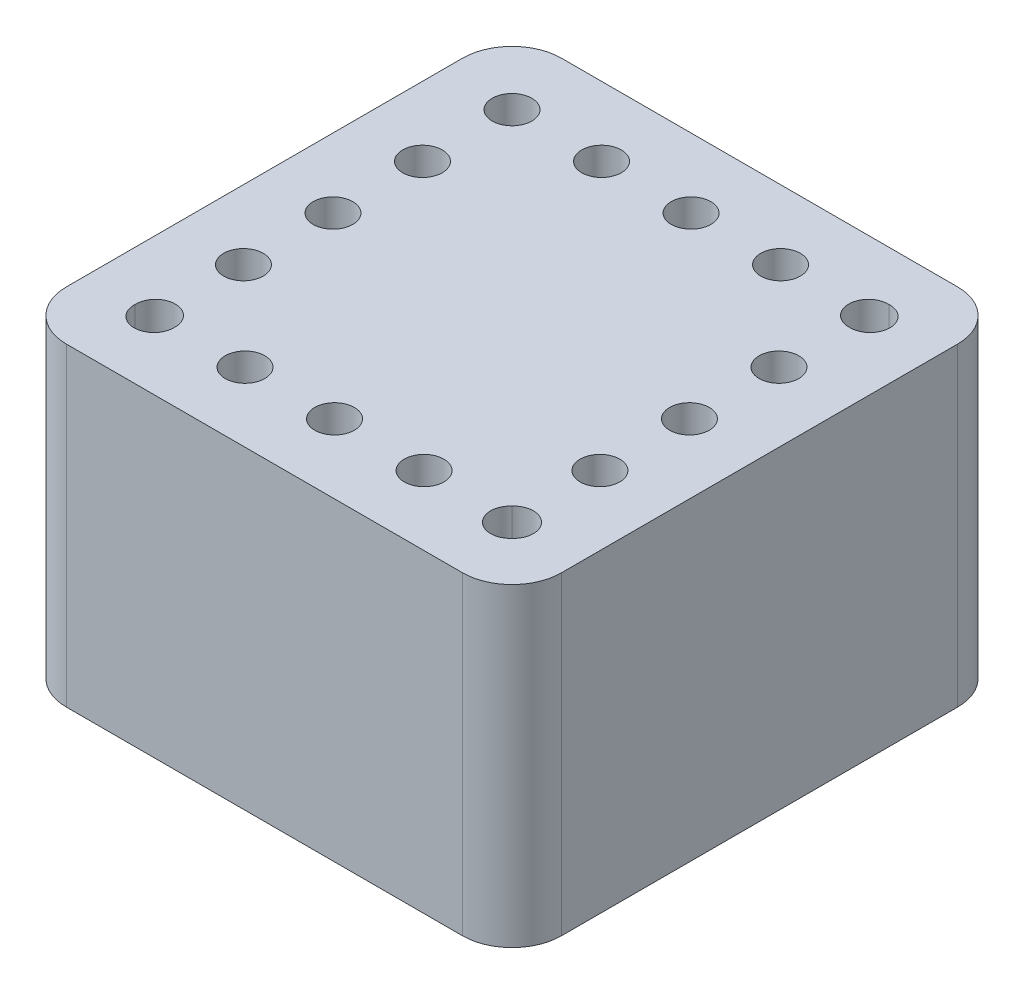
ISO-10303-21;
HEADER;
FILE_DESCRIPTION(('STEP AP214'),'2;1');
FILE_NAME('part.step','',(''),(''),'','','');
FILE_SCHEMA(('AUTOMOTIVE_DESIGN { 1 0 10303 214 1 1 1 1 }'));
ENDSEC;
DATA;
#1=APPLICATION_CONTEXT('core data for automotive mechanical design processes');
#2=APPLICATION_PROTOCOL_DEFINITION('international standard','automotive_design',2000,#1);
#3=PRODUCT_CONTEXT('',#1,'mechanical');
#4=PRODUCT('Part','Part','',(#3));
#5=PRODUCT_RELATED_PRODUCT_CATEGORY('part','',(#4));
#6=PRODUCT_DEFINITION_FORMATION('','',#4);
#7=PRODUCT_DEFINITION_CONTEXT('part definition',#1,'design');
#8=PRODUCT_DEFINITION('design','',#6,#7);
#9=PRODUCT_DEFINITION_SHAPE('','',#8);
#10=(LENGTH_UNIT() NAMED_UNIT(*) SI_UNIT(.MILLI.,.METRE.));
#11=(NAMED_UNIT(*) PLANE_ANGLE_UNIT() SI_UNIT($,.RADIAN.));
#12=(NAMED_UNIT(*) SI_UNIT($,.STERADIAN.) SOLID_ANGLE_UNIT());
#13=UNCERTAINTY_MEASURE_WITH_UNIT(LENGTH_MEASURE(1.E-05),#10,'distance_accuracy_value','');
#14=(GEOMETRIC_REPRESENTATION_CONTEXT(3) GLOBAL_UNCERTAINTY_ASSIGNED_CONTEXT((#13)) GLOBAL_UNIT_ASSIGNED_CONTEXT((#10,
#11,#12)) REPRESENTATION_CONTEXT('',''));
#15=CARTESIAN_POINT('',(0.,0.,0.));
#16=DIRECTION('',(0.,0.,1.));
#17=DIRECTION('',(1.,0.,0.));
#18=AXIS2_PLACEMENT_3D('',#15,#16,#17);
#19=CARTESIAN_POINT('',(1.4,4.75,-1.368));
#20=DIRECTION('',(0.,1.,0.));
#21=DIRECTION('',(0.,0.,1.));
#22=AXIS2_PLACEMENT_3D('',#19,#20,#21);
#23=CYLINDRICAL_SURFACE('',#22,0.399999999999999);
#24=DIRECTION('',(0.,1.,0.));
#25=VECTOR('',#24,1.);
#26=CARTESIAN_POINT('',(1.0003201281025,5.55,-1.384));
#27=LINE('',#26,#25);
#28=CARTESIAN_POINT('',(1.0003201281025,6.35,-1.384));
#29=VERTEX_POINT('',#28);
#30=CARTESIAN_POINT('',(1.0003201281025,4.75,-1.384));
#31=VERTEX_POINT('',#30);
#32=EDGE_CURVE('E161',#29,#31,#27,.F.);
#33=ORIENTED_EDGE('',*,*,#32,.F.);
#34=CARTESIAN_POINT('',(1.4,6.35,-1.368));
#35=DIRECTION('',(0.,1.,0.));
#36=DIRECTION('',(0.,0.,1.));
#37=AXIS2_PLACEMENT_3D('',#34,#35,#36);
#38=CIRCLE('',#37,0.399999999999999);
#39=CARTESIAN_POINT('',(1.7996798718975,6.35,-1.384));
#40=VERTEX_POINT('',#39);
#41=EDGE_CURVE('E176',#29,#40,#38,.T.);
#42=ORIENTED_EDGE('',*,*,#41,.T.);
#43=DIRECTION('',(0.,1.,0.));
#44=VECTOR('',#43,1.);
#45=CARTESIAN_POINT('',(1.7996798718975,5.55,-1.384));
#46=LINE('',#45,#44);
#47=CARTESIAN_POINT('',(1.7996798718975,4.75,-1.384));
#48=VERTEX_POINT('',#47);
#49=EDGE_CURVE('E770',#48,#40,#46,.T.);
#50=ORIENTED_EDGE('',*,*,#49,.F.);
#51=CARTESIAN_POINT('',(1.4,4.75,-1.368));
#52=DIRECTION('',(0.,1.,0.));
#53=DIRECTION('',(0.,0.,1.));
#54=AXIS2_PLACEMENT_3D('',#51,#52,#53);
#55=CIRCLE('',#54,0.399999999999999);
#56=EDGE_CURVE('E177',#31,#48,#55,.T.);
#57=ORIENTED_EDGE('',*,*,#56,.F.);
#58=EDGE_LOOP('',(#33,#42,#50,#57));
#59=FACE_BOUND('',#58,.T.);
#60=ADVANCED_FACE('F39',(#59),#23,.F.);
#61=CARTESIAN_POINT('',(8.6,4.75,-1.368));
#62=DIRECTION('',(0.,1.,0.));
#63=DIRECTION('',(0.,0.,1.));
#64=AXIS2_PLACEMENT_3D('',#61,#62,#63);
#65=CYLINDRICAL_SURFACE('',#64,0.399999999999999);
#66=CARTESIAN_POINT('',(8.6,4.75,-1.368));
#67=DIRECTION('',(0.,-1.,0.));
#68=DIRECTION('',(0.,0.,1.));
#69=AXIS2_PLACEMENT_3D('',#66,#67,#68);
#70=CIRCLE('',#69,0.399999999999999);
#71=CARTESIAN_POINT('',(8.89838980151556,4.75,-1.10161019848444));
#72=VERTEX_POINT('',#71);
#73=CARTESIAN_POINT('',(8.33361019848444,4.75,-1.66638980151556));
#74=VERTEX_POINT('',#73);
#75=EDGE_CURVE('E151',#72,#74,#70,.T.);
#76=ORIENTED_EDGE('',*,*,#75,.T.);
#77=DIRECTION('',(0.,1.,0.));
#78=VECTOR('',#77,1.);
#79=CARTESIAN_POINT('',(8.33361019848444,5.55,-1.66638980151556));
#80=LINE('',#79,#78);
#81=CARTESIAN_POINT('',(8.33361019848444,6.35,-1.66638980151556));
#82=VERTEX_POINT('',#81);
#83=EDGE_CURVE('E143',#74,#82,#80,.T.);
#84=ORIENTED_EDGE('',*,*,#83,.T.);
#85=CARTESIAN_POINT('',(8.6,6.35,-1.368));
#86=DIRECTION('',(0.,-1.,0.));
#87=DIRECTION('',(0.,0.,1.));
#88=AXIS2_PLACEMENT_3D('',#85,#86,#87);
#89=CIRCLE('',#88,0.399999999999999);
#90=CARTESIAN_POINT('',(8.89838980151556,6.35,-1.10161019848444));
#91=VERTEX_POINT('',#90);
#92=EDGE_CURVE('E153',#91,#82,#89,.T.);
#93=ORIENTED_EDGE('',*,*,#92,.F.);
#94=DIRECTION('',(0.,1.,0.));
#95=VECTOR('',#94,1.);
#96=CARTESIAN_POINT('',(8.89838980151556,5.55,-1.10161019848444));
#97=LINE('',#96,#95);
#98=EDGE_CURVE('E140',#91,#72,#97,.F.);
#99=ORIENTED_EDGE('',*,*,#98,.T.);
#100=EDGE_LOOP('',(#76,#84,#93,#99));
#101=FACE_BOUND('',#100,.T.);
#102=ADVANCED_FACE('F150',(#101),#65,.F.);
#103=CARTESIAN_POINT('',(8.632,4.75,-8.6));
#104=DIRECTION('',(0.,1.,0.));
#105=DIRECTION('',(0.,0.,1.));
#106=AXIS2_PLACEMENT_3D('',#103,#104,#105);
#107=CYLINDRICAL_SURFACE('',#106,0.399999999999999);
#108=DIRECTION('',(0.,1.,0.));
#109=VECTOR('',#108,1.);
#110=CARTESIAN_POINT('',(8.616,5.55,-8.2003201281025));
#111=LINE('',#110,#109);
#112=CARTESIAN_POINT('',(8.616,6.35,-8.2003201281025));
#113=VERTEX_POINT('',#112);
#114=CARTESIAN_POINT('',(8.616,4.75,-8.2003201281025));
#115=VERTEX_POINT('',#114);
#116=EDGE_CURVE('E173',#113,#115,#111,.F.);
#117=ORIENTED_EDGE('',*,*,#116,.F.);
#118=CARTESIAN_POINT('',(8.632,6.35,-8.6));
#119=DIRECTION('',(0.,1.,0.));
#120=DIRECTION('',(0.,0.,1.));
#121=AXIS2_PLACEMENT_3D('',#118,#119,#120);
#122=CIRCLE('',#121,0.399999999999999);
#123=CARTESIAN_POINT('',(8.616,6.35,-8.9996798718975));
#124=VERTEX_POINT('',#123);
#125=EDGE_CURVE('E199',#113,#124,#122,.T.);
#126=ORIENTED_EDGE('',*,*,#125,.T.);
#127=DIRECTION('',(0.,1.,0.));
#128=VECTOR('',#127,1.);
#129=CARTESIAN_POINT('',(8.616,5.55,-8.9996798718975));
#130=LINE('',#129,#128);
#131=CARTESIAN_POINT('',(8.616,4.75,-8.9996798718975));
#132=VERTEX_POINT('',#131);
#133=EDGE_CURVE('E167',#132,#124,#130,.T.);
#134=ORIENTED_EDGE('',*,*,#133,.F.);
#135=CARTESIAN_POINT('',(8.632,4.75,-8.6));
#136=DIRECTION('',(0.,1.,0.));
#137=DIRECTION('',(0.,0.,1.));
#138=AXIS2_PLACEMENT_3D('',#135,#136,#137);
#139=CIRCLE('',#138,0.399999999999999);
#140=EDGE_CURVE('E200',#115,#132,#139,.T.);
#141=ORIENTED_EDGE('',*,*,#140,.F.);
#142=EDGE_LOOP('',(#117,#126,#134,#141));
#143=FACE_BOUND('',#142,.T.);
#144=ADVANCED_FACE('F336',(#143),#107,.F.);
#145=CARTESIAN_POINT('',(0.,6.35,0.));
#146=DIRECTION('',(1.,0.,0.));
#147=DIRECTION('',(0.,0.,-1.));
#148=AXIS2_PLACEMENT_3D('',#145,#146,#147);
#149=PLANE('',#148);
#150=DIRECTION('',(0.,0.,1.));
#151=VECTOR('',#150,1.);
#152=CARTESIAN_POINT('',(0.,6.35,0.));
#153=LINE('',#152,#151);
#154=CARTESIAN_POINT('',(0.,6.35,-9.));
#155=VERTEX_POINT('',#154);
#156=CARTESIAN_POINT('',(0.,6.35,-1.));
#157=VERTEX_POINT('',#156);
#158=EDGE_CURVE('E230',#155,#157,#153,.T.);
#159=ORIENTED_EDGE('',*,*,#158,.F.);
#160=DIRECTION('',(0.,-1.,0.));
#161=VECTOR('',#160,1.);
#162=CARTESIAN_POINT('',(0.,6.35,-9.));
#163=LINE('',#162,#161);
#164=CARTESIAN_POINT('',(0.,0.,-9.));
#165=VERTEX_POINT('',#164);
#166=EDGE_CURVE('E281',#155,#165,#163,.T.);
#167=ORIENTED_EDGE('',*,*,#166,.T.);
#168=DIRECTION('',(0.,0.,1.));
#169=VECTOR('',#168,1.);
#170=CARTESIAN_POINT('',(0.,0.,0.));
#171=LINE('',#170,#169);
#172=CARTESIAN_POINT('',(0.,0.,-1.));
#173=VERTEX_POINT('',#172);
#174=EDGE_CURVE('E227',#165,#173,#171,.T.);
#175=ORIENTED_EDGE('',*,*,#174,.T.);
#176=DIRECTION('',(0.,-1.,0.));
#177=VECTOR('',#176,1.);
#178=CARTESIAN_POINT('',(0.,6.35,-1.));
#179=LINE('',#178,#177);
#180=EDGE_CURVE('E279',#173,#157,#179,.F.);
#181=ORIENTED_EDGE('',*,*,#180,.T.);
#182=EDGE_LOOP('',(#159,#167,#175,#181));
#183=FACE_BOUND('',#182,.T.);
#184=ADVANCED_FACE('F318',(#183),#149,.F.);
#185=CARTESIAN_POINT('',(0.,6.35,0.));
#186=DIRECTION('',(0.,0.,-1.));
#187=DIRECTION('',(-1.,0.,0.));
#188=AXIS2_PLACEMENT_3D('',#185,#186,#187);
#189=PLANE('',#188);
#190=DIRECTION('',(1.,0.,0.));
#191=VECTOR('',#190,1.);
#192=CARTESIAN_POINT('',(0.,6.35,0.));
#193=LINE('',#192,#191);
#194=CARTESIAN_POINT('',(1.,6.35,0.));
#195=VERTEX_POINT('',#194);
#196=CARTESIAN_POINT('',(9.,6.35,0.));
#197=VERTEX_POINT('',#196);
#198=EDGE_CURVE('E233',#195,#197,#193,.T.);
#199=ORIENTED_EDGE('',*,*,#198,.F.);
#200=DIRECTION('',(0.,-1.,0.));
#201=VECTOR('',#200,1.);
#202=CARTESIAN_POINT('',(1.,6.35,0.));
#203=LINE('',#202,#201);
#204=CARTESIAN_POINT('',(1.,0.,0.));
#205=VERTEX_POINT('',#204);
#206=EDGE_CURVE('E11',#195,#205,#203,.T.);
#207=ORIENTED_EDGE('',*,*,#206,.T.);
#208=DIRECTION('',(1.,0.,0.));
#209=VECTOR('',#208,1.);
#210=CARTESIAN_POINT('',(0.,0.,0.));
#211=LINE('',#210,#209);
#212=CARTESIAN_POINT('',(9.,0.,0.));
#213=VERTEX_POINT('',#212);
#214=EDGE_CURVE('E246',#205,#213,#211,.T.);
#215=ORIENTED_EDGE('',*,*,#214,.T.);
#216=DIRECTION('',(0.,-1.,0.));
#217=VECTOR('',#216,1.);
#218=CARTESIAN_POINT('',(9.,6.35,0.));
#219=LINE('',#218,#217);
#220=EDGE_CURVE('E47',#213,#197,#219,.F.);
#221=ORIENTED_EDGE('',*,*,#220,.T.);
#222=EDGE_LOOP('',(#199,#207,#215,#221));
#223=FACE_BOUND('',#222,.T.);
#224=ADVANCED_FACE('F286',(#223),#189,.F.);
#225=CARTESIAN_POINT('',(10.,6.35,0.));
#226=DIRECTION('',(-1.,0.,0.));
#227=DIRECTION('',(0.,0.,1.));
#228=AXIS2_PLACEMENT_3D('',#225,#226,#227);
#229=PLANE('',#228);
#230=DIRECTION('',(0.,0.,-1.));
#231=VECTOR('',#230,1.);
#232=CARTESIAN_POINT('',(10.,0.,0.));
#233=LINE('',#232,#231);
#234=CARTESIAN_POINT('',(10.,0.,-1.));
#235=VERTEX_POINT('',#234);
#236=CARTESIAN_POINT('',(10.,0.,-9.));
#237=VERTEX_POINT('',#236);
#238=EDGE_CURVE('E249',#235,#237,#233,.T.);
#239=ORIENTED_EDGE('',*,*,#238,.T.);
#240=DIRECTION('',(0.,-1.,0.));
#241=VECTOR('',#240,1.);
#242=CARTESIAN_POINT('',(10.,6.35,-9.));
#243=LINE('',#242,#241);
#244=CARTESIAN_POINT('',(10.,6.35,-9.));
#245=VERTEX_POINT('',#244);
#246=EDGE_CURVE('E269',#237,#245,#243,.F.);
#247=ORIENTED_EDGE('',*,*,#246,.T.);
#248=DIRECTION('',(0.,0.,-1.));
#249=VECTOR('',#248,1.);
#250=CARTESIAN_POINT('',(10.,6.35,0.));
#251=LINE('',#250,#249);
#252=CARTESIAN_POINT('',(10.,6.35,-1.));
#253=VERTEX_POINT('',#252);
#254=EDGE_CURVE('E237',#253,#245,#251,.T.);
#255=ORIENTED_EDGE('',*,*,#254,.F.);
#256=DIRECTION('',(0.,-1.,0.));
#257=VECTOR('',#256,1.);
#258=CARTESIAN_POINT('',(10.,6.35,-1.));
#259=LINE('',#258,#257);
#260=EDGE_CURVE('E266',#253,#235,#259,.T.);
#261=ORIENTED_EDGE('',*,*,#260,.T.);
#262=EDGE_LOOP('',(#239,#247,#255,#261));
#263=FACE_BOUND('',#262,.T.);
#264=ADVANCED_FACE('F298',(#263),#229,.F.);
#265=CARTESIAN_POINT('',(0.,6.35,-10.));
#266=DIRECTION('',(0.,0.,1.));
#267=DIRECTION('',(1.,0.,0.));
#268=AXIS2_PLACEMENT_3D('',#265,#266,#267);
#269=PLANE('',#268);
#270=DIRECTION('',(-1.,0.,0.));
#271=VECTOR('',#270,1.);
#272=CARTESIAN_POINT('',(0.,6.35,-10.));
#273=LINE('',#272,#271);
#274=CARTESIAN_POINT('',(9.,6.35,-10.));
#275=VERTEX_POINT('',#274);
#276=CARTESIAN_POINT('',(1.,6.35,-10.));
#277=VERTEX_POINT('',#276);
#278=EDGE_CURVE('E240',#275,#277,#273,.T.);
#279=ORIENTED_EDGE('',*,*,#278,.F.);
#280=DIRECTION('',(0.,-1.,0.));
#281=VECTOR('',#280,1.);
#282=CARTESIAN_POINT('',(9.,6.35,-10.));
#283=LINE('',#282,#281);
#284=CARTESIAN_POINT('',(9.,0.,-10.));
#285=VERTEX_POINT('',#284);
#286=EDGE_CURVE('E255',#275,#285,#283,.T.);
#287=ORIENTED_EDGE('',*,*,#286,.T.);
#288=DIRECTION('',(-1.,0.,0.));
#289=VECTOR('',#288,1.);
#290=CARTESIAN_POINT('',(0.,0.,-10.));
#291=LINE('',#290,#289);
#292=CARTESIAN_POINT('',(1.,0.,-10.));
#293=VERTEX_POINT('',#292);
#294=EDGE_CURVE('E234',#285,#293,#291,.T.);
#295=ORIENTED_EDGE('',*,*,#294,.T.);
#296=DIRECTION('',(0.,-1.,0.));
#297=VECTOR('',#296,1.);
#298=CARTESIAN_POINT('',(1.,6.35,-10.));
#299=LINE('',#298,#297);
#300=EDGE_CURVE('E243',#293,#277,#299,.F.);
#301=ORIENTED_EDGE('',*,*,#300,.T.);
#302=EDGE_LOOP('',(#279,#287,#295,#301));
#303=FACE_BOUND('',#302,.T.);
#304=ADVANCED_FACE('F309',(#303),#269,.F.);
#305=CARTESIAN_POINT('',(0.,6.35,0.));
#306=DIRECTION('',(0.,-1.,0.));
#307=DIRECTION('',(0.,0.,-1.));
#308=AXIS2_PLACEMENT_3D('',#305,#306,#307);
#309=PLANE('',#308);
#310=CARTESIAN_POINT('',(1.4,6.35,-1.4));
#311=DIRECTION('',(0.,-1.,0.));
#312=DIRECTION('',(0.,0.,-1.));
#313=AXIS2_PLACEMENT_3D('',#310,#311,#312);
#314=CIRCLE('',#313,0.399999999999999);
#315=EDGE_CURVE('E748',#29,#40,#314,.T.);
#316=ORIENTED_EDGE('',*,*,#315,.T.);
#317=ORIENTED_EDGE('',*,*,#41,.F.);
#318=EDGE_LOOP('',(#316,#317));
#319=FACE_BOUND('',#318,.T.);
#320=CARTESIAN_POINT('',(3.208,6.35,-1.4));
#321=DIRECTION('',(0.,-1.,0.));
#322=DIRECTION('',(0.,0.,-1.));
#323=AXIS2_PLACEMENT_3D('',#320,#321,#322);
#324=CIRCLE('',#323,0.399999999999999);
#325=CARTESIAN_POINT('',(3.208,6.35,-1.8));
#326=VERTEX_POINT('',#325);
#327=EDGE_CURVE('E749',#326,#326,#324,.T.);
#328=ORIENTED_EDGE('',*,*,#327,.T.);
#329=EDGE_LOOP('',(#328));
#330=FACE_BOUND('',#329,.T.);
#331=CARTESIAN_POINT('',(5.016,6.35,-1.4));
#332=DIRECTION('',(0.,-1.,0.));
#333=DIRECTION('',(0.,0.,-1.));
#334=AXIS2_PLACEMENT_3D('',#331,#332,#333);
#335=CIRCLE('',#334,0.399999999999999);
#336=CARTESIAN_POINT('',(5.016,6.35,-1.8));
#337=VERTEX_POINT('',#336);
#338=EDGE_CURVE('E760',#337,#337,#335,.T.);
#339=ORIENTED_EDGE('',*,*,#338,.T.);
#340=EDGE_LOOP('',(#339));
#341=FACE_BOUND('',#340,.T.);
#342=CARTESIAN_POINT('',(6.824,6.35,-1.4));
#343=DIRECTION('',(0.,-1.,0.));
#344=DIRECTION('',(0.,0.,-1.));
#345=AXIS2_PLACEMENT_3D('',#342,#343,#344);
#346=CIRCLE('',#345,0.399999999999999);
#347=CARTESIAN_POINT('',(6.824,6.35,-1.8));
#348=VERTEX_POINT('',#347);
#349=EDGE_CURVE('E145',#348,#348,#346,.T.);
#350=ORIENTED_EDGE('',*,*,#349,.T.);
#351=EDGE_LOOP('',(#350));
#352=FACE_BOUND('',#351,.T.);
#353=CARTESIAN_POINT('',(8.632,6.35,-1.4));
#354=DIRECTION('',(0.,-1.,0.));
#355=DIRECTION('',(0.,0.,-1.));
#356=AXIS2_PLACEMENT_3D('',#353,#354,#355);
#357=CIRCLE('',#356,0.399999999999999);
#358=EDGE_CURVE('E146',#82,#91,#357,.T.);
#359=ORIENTED_EDGE('',*,*,#358,.T.);
#360=ORIENTED_EDGE('',*,*,#92,.T.);
#361=EDGE_LOOP('',(#359,#360));
#362=FACE_BOUND('',#361,.T.);
#363=CARTESIAN_POINT('',(8.6,6.35,-6.792));
#364=DIRECTION('',(0.,-1.,0.));
#365=DIRECTION('',(0.,0.,1.));
#366=AXIS2_PLACEMENT_3D('',#363,#364,#365);
#367=CIRCLE('',#366,0.399999999999999);
#368=CARTESIAN_POINT('',(8.6,6.35,-6.392));
#369=VERTEX_POINT('',#368);
#370=EDGE_CURVE('E775',#369,#369,#367,.T.);
#371=ORIENTED_EDGE('',*,*,#370,.T.);
#372=EDGE_LOOP('',(#371));
#373=FACE_BOUND('',#372,.T.);
#374=CARTESIAN_POINT('',(8.6,6.35,-4.984));
#375=DIRECTION('',(0.,-1.,0.));
#376=DIRECTION('',(0.,0.,1.));
#377=AXIS2_PLACEMENT_3D('',#374,#375,#376);
#378=CIRCLE('',#377,0.399999999999999);
#379=CARTESIAN_POINT('',(8.6,6.35,-4.584));
#380=VERTEX_POINT('',#379);
#381=EDGE_CURVE('E781',#380,#380,#378,.T.);
#382=ORIENTED_EDGE('',*,*,#381,.T.);
#383=EDGE_LOOP('',(#382));
#384=FACE_BOUND('',#383,.T.);
#385=CARTESIAN_POINT('',(8.6,6.35,-3.176));
#386=DIRECTION('',(0.,-1.,0.));
#387=DIRECTION('',(0.,0.,1.));
#388=AXIS2_PLACEMENT_3D('',#385,#386,#387);
#389=CIRCLE('',#388,0.399999999999999);
#390=CARTESIAN_POINT('',(8.6,6.35,-2.776));
#391=VERTEX_POINT('',#390);
#392=EDGE_CURVE('E156',#391,#391,#389,.T.);
#393=ORIENTED_EDGE('',*,*,#392,.T.);
#394=EDGE_LOOP('',(#393));
#395=FACE_BOUND('',#394,.T.);
#396=CARTESIAN_POINT('',(8.6,6.35,-8.6));
#397=DIRECTION('',(0.,-1.,0.));
#398=DIRECTION('',(0.,0.,1.));
#399=AXIS2_PLACEMENT_3D('',#396,#397,#398);
#400=CIRCLE('',#399,0.399999999999999);
#401=EDGE_CURVE('E168',#113,#124,#400,.T.);
#402=ORIENTED_EDGE('',*,*,#401,.T.);
#403=ORIENTED_EDGE('',*,*,#125,.F.);
#404=EDGE_LOOP('',(#402,#403));
#405=FACE_BOUND('',#404,.T.);
#406=CARTESIAN_POINT('',(1.4,6.35,-3.176));
#407=DIRECTION('',(0.,1.,0.));
#408=DIRECTION('',(0.,0.,1.));
#409=AXIS2_PLACEMENT_3D('',#406,#407,#408);
#410=CIRCLE('',#409,0.399999999999999);
#411=CARTESIAN_POINT('',(1.4,6.35,-2.776));
#412=VERTEX_POINT('',#411);
#413=EDGE_CURVE('E179',#412,#412,#410,.T.);
#414=ORIENTED_EDGE('',*,*,#413,.F.);
#415=EDGE_LOOP('',(#414));
#416=FACE_BOUND('',#415,.T.);
#417=CARTESIAN_POINT('',(1.4,6.35,-4.984));
#418=DIRECTION('',(0.,1.,0.));
#419=DIRECTION('',(0.,0.,1.));
#420=AXIS2_PLACEMENT_3D('',#417,#418,#419);
#421=CIRCLE('',#420,0.399999999999999);
#422=CARTESIAN_POINT('',(1.4,6.35,-4.584));
#423=VERTEX_POINT('',#422);
#424=EDGE_CURVE('E187',#423,#423,#421,.T.);
#425=ORIENTED_EDGE('',*,*,#424,.F.);
#426=EDGE_LOOP('',(#425));
#427=FACE_BOUND('',#426,.T.);
#428=CARTESIAN_POINT('',(1.4,6.35,-6.792));
#429=DIRECTION('',(0.,1.,0.));
#430=DIRECTION('',(0.,0.,1.));
#431=AXIS2_PLACEMENT_3D('',#428,#429,#430);
#432=CIRCLE('',#431,0.399999999999999);
#433=CARTESIAN_POINT('',(1.4,6.35,-6.392));
#434=VERTEX_POINT('',#433);
#435=EDGE_CURVE('E193',#434,#434,#432,.T.);
#436=ORIENTED_EDGE('',*,*,#435,.F.);
#437=EDGE_LOOP('',(#436));
#438=FACE_BOUND('',#437,.T.);
#439=CARTESIAN_POINT('',(6.824,6.35,-8.6));
#440=DIRECTION('',(0.,1.,0.));
#441=DIRECTION('',(0.,0.,1.));
#442=AXIS2_PLACEMENT_3D('',#439,#440,#441);
#443=CIRCLE('',#442,0.399999999999999);
#444=CARTESIAN_POINT('',(6.824,6.35,-8.2));
#445=VERTEX_POINT('',#444);
#446=EDGE_CURVE('E203',#445,#445,#443,.T.);
#447=ORIENTED_EDGE('',*,*,#446,.F.);
#448=EDGE_LOOP('',(#447));
#449=FACE_BOUND('',#448,.T.);
#450=CARTESIAN_POINT('',(5.016,6.35,-8.6));
#451=DIRECTION('',(0.,1.,0.));
#452=DIRECTION('',(0.,0.,1.));
#453=AXIS2_PLACEMENT_3D('',#450,#451,#452);
#454=CIRCLE('',#453,0.399999999999999);
#455=CARTESIAN_POINT('',(5.016,6.35,-8.2));
#456=VERTEX_POINT('',#455);
#457=EDGE_CURVE('E211',#456,#456,#454,.T.);
#458=ORIENTED_EDGE('',*,*,#457,.F.);
#459=EDGE_LOOP('',(#458));
#460=FACE_BOUND('',#459,.T.);
#461=CARTESIAN_POINT('',(3.208,6.35,-8.6));
#462=DIRECTION('',(0.,1.,0.));
#463=DIRECTION('',(0.,0.,1.));
#464=AXIS2_PLACEMENT_3D('',#461,#462,#463);
#465=CIRCLE('',#464,0.399999999999999);
#466=CARTESIAN_POINT('',(3.208,6.35,-8.2));
#467=VERTEX_POINT('',#466);
#468=EDGE_CURVE('E217',#467,#467,#465,.T.);
#469=ORIENTED_EDGE('',*,*,#468,.F.);
#470=EDGE_LOOP('',(#469));
#471=FACE_BOUND('',#470,.T.);
#472=CARTESIAN_POINT('',(1.4,6.35,-8.6));
#473=DIRECTION('',(0.,1.,0.));
#474=DIRECTION('',(0.,0.,1.));
#475=AXIS2_PLACEMENT_3D('',#472,#473,#474);
#476=CIRCLE('',#475,0.399999999999999);
#477=CARTESIAN_POINT('',(1.4,6.35,-8.2));
#478=VERTEX_POINT('',#477);
#479=EDGE_CURVE('E223',#478,#478,#476,.T.);
#480=ORIENTED_EDGE('',*,*,#479,.F.);
#481=EDGE_LOOP('',(#480));
#482=FACE_BOUND('',#481,.T.);
#483=ORIENTED_EDGE('',*,*,#254,.T.);
#484=CARTESIAN_POINT('',(9.,6.35,-9.));
#485=DIRECTION('',(0.,-1.,0.));
#486=DIRECTION('',(0.,0.,-1.));
#487=AXIS2_PLACEMENT_3D('',#484,#485,#486);
#488=CIRCLE('',#487,1.);
#489=EDGE_CURVE('E277',#245,#275,#488,.F.);
#490=ORIENTED_EDGE('',*,*,#489,.T.);
#491=ORIENTED_EDGE('',*,*,#278,.T.);
#492=CARTESIAN_POINT('',(1.,6.35,-9.));
#493=DIRECTION('',(0.,-1.,0.));
#494=DIRECTION('',(0.,0.,-1.));
#495=AXIS2_PLACEMENT_3D('',#492,#493,#494);
#496=CIRCLE('',#495,1.);
#497=EDGE_CURVE('E275',#277,#155,#496,.F.);
#498=ORIENTED_EDGE('',*,*,#497,.T.);
#499=ORIENTED_EDGE('',*,*,#158,.T.);
#500=CARTESIAN_POINT('',(1.,6.35,-1.));
#501=DIRECTION('',(0.,-1.,0.));
#502=DIRECTION('',(0.,0.,-1.));
#503=AXIS2_PLACEMENT_3D('',#500,#501,#502);
#504=CIRCLE('',#503,1.);
#505=EDGE_CURVE('E273',#157,#195,#504,.F.);
#506=ORIENTED_EDGE('',*,*,#505,.T.);
#507=ORIENTED_EDGE('',*,*,#198,.T.);
#508=CARTESIAN_POINT('',(9.,6.35,-1.));
#509=DIRECTION('',(0.,-1.,0.));
#510=DIRECTION('',(0.,0.,-1.));
#511=AXIS2_PLACEMENT_3D('',#508,#509,#510);
#512=CIRCLE('',#511,1.);
#513=EDGE_CURVE('E271',#197,#253,#512,.F.);
#514=ORIENTED_EDGE('',*,*,#513,.T.);
#515=EDGE_LOOP('',(#483,#490,#491,#498,#499,#506,#507,#514));
#516=FACE_BOUND('',#515,.T.);
#517=ADVANCED_FACE('F292',(#319,#330,#341,#352,#362,#373,#384,#395,#405,#416,#427,#438,#449,
#460,#471,#482,#516),#309,.F.);
#518=CARTESIAN_POINT('',(0.,0.,0.));
#519=DIRECTION('',(0.,-1.,0.));
#520=DIRECTION('',(0.,0.,-1.));
#521=AXIS2_PLACEMENT_3D('',#518,#519,#520);
#522=PLANE('',#521);
#523=ORIENTED_EDGE('',*,*,#294,.F.);
#524=CARTESIAN_POINT('',(9.,0.,-9.));
#525=DIRECTION('',(0.,-1.,0.));
#526=DIRECTION('',(0.,0.,-1.));
#527=AXIS2_PLACEMENT_3D('',#524,#525,#526);
#528=CIRCLE('',#527,1.);
#529=EDGE_CURVE('E264',#285,#237,#528,.T.);
#530=ORIENTED_EDGE('',*,*,#529,.T.);
#531=ORIENTED_EDGE('',*,*,#238,.F.);
#532=CARTESIAN_POINT('',(9.,0.,-1.));
#533=DIRECTION('',(0.,-1.,0.));
#534=DIRECTION('',(0.,0.,-1.));
#535=AXIS2_PLACEMENT_3D('',#532,#533,#534);
#536=CIRCLE('',#535,1.);
#537=EDGE_CURVE('E258',#235,#213,#536,.T.);
#538=ORIENTED_EDGE('',*,*,#537,.T.);
#539=ORIENTED_EDGE('',*,*,#214,.F.);
#540=CARTESIAN_POINT('',(1.,0.,-1.));
#541=DIRECTION('',(0.,-1.,0.));
#542=DIRECTION('',(0.,0.,-1.));
#543=AXIS2_PLACEMENT_3D('',#540,#541,#542);
#544=CIRCLE('',#543,1.);
#545=EDGE_CURVE('E260',#205,#173,#544,.T.);
#546=ORIENTED_EDGE('',*,*,#545,.T.);
#547=ORIENTED_EDGE('',*,*,#174,.F.);
#548=CARTESIAN_POINT('',(1.,0.,-9.));
#549=DIRECTION('',(0.,-1.,0.));
#550=DIRECTION('',(0.,0.,-1.));
#551=AXIS2_PLACEMENT_3D('',#548,#549,#550);
#552=CIRCLE('',#551,1.);
#553=EDGE_CURVE('E262',#165,#293,#552,.T.);
#554=ORIENTED_EDGE('',*,*,#553,.T.);
#555=EDGE_LOOP('',(#523,#530,#531,#538,#539,#546,#547,#554));
#556=FACE_BOUND('',#555,.T.);
#557=ADVANCED_FACE('F302',(#556),#522,.T.);
#558=CARTESIAN_POINT('',(9.,6.35,-9.));
#559=DIRECTION('',(0.,-1.,0.));
#560=DIRECTION('',(0.,0.,-1.));
#561=AXIS2_PLACEMENT_3D('',#558,#559,#560);
#562=CYLINDRICAL_SURFACE('',#561,1.);
#563=ORIENTED_EDGE('',*,*,#489,.F.);
#564=ORIENTED_EDGE('',*,*,#246,.F.);
#565=ORIENTED_EDGE('',*,*,#529,.F.);
#566=ORIENTED_EDGE('',*,*,#286,.F.);
#567=EDGE_LOOP('',(#563,#564,#565,#566));
#568=FACE_BOUND('',#567,.T.);
#569=ADVANCED_FACE('F306',(#568),#562,.T.);
#570=CARTESIAN_POINT('',(1.,6.35,-9.));
#571=DIRECTION('',(0.,-1.,0.));
#572=DIRECTION('',(0.,0.,-1.));
#573=AXIS2_PLACEMENT_3D('',#570,#571,#572);
#574=CYLINDRICAL_SURFACE('',#573,1.);
#575=ORIENTED_EDGE('',*,*,#497,.F.);
#576=ORIENTED_EDGE('',*,*,#300,.F.);
#577=ORIENTED_EDGE('',*,*,#553,.F.);
#578=ORIENTED_EDGE('',*,*,#166,.F.);
#579=EDGE_LOOP('',(#575,#576,#577,#578));
#580=FACE_BOUND('',#579,.T.);
#581=ADVANCED_FACE('F315',(#580),#574,.T.);
#582=CARTESIAN_POINT('',(1.,6.35,-1.));
#583=DIRECTION('',(0.,-1.,0.));
#584=DIRECTION('',(0.,0.,-1.));
#585=AXIS2_PLACEMENT_3D('',#582,#583,#584);
#586=CYLINDRICAL_SURFACE('',#585,1.);
#587=ORIENTED_EDGE('',*,*,#505,.F.);
#588=ORIENTED_EDGE('',*,*,#180,.F.);
#589=ORIENTED_EDGE('',*,*,#545,.F.);
#590=ORIENTED_EDGE('',*,*,#206,.F.);
#591=EDGE_LOOP('',(#587,#588,#589,#590));
#592=FACE_BOUND('',#591,.T.);
#593=ADVANCED_FACE('F321',(#592),#586,.T.);
#594=CARTESIAN_POINT('',(9.,6.35,-1.));
#595=DIRECTION('',(0.,-1.,0.));
#596=DIRECTION('',(0.,0.,-1.));
#597=AXIS2_PLACEMENT_3D('',#594,#595,#596);
#598=CYLINDRICAL_SURFACE('',#597,1.);
#599=ORIENTED_EDGE('',*,*,#513,.F.);
#600=ORIENTED_EDGE('',*,*,#220,.F.);
#601=ORIENTED_EDGE('',*,*,#537,.F.);
#602=ORIENTED_EDGE('',*,*,#260,.F.);
#603=EDGE_LOOP('',(#599,#600,#601,#602));
#604=FACE_BOUND('',#603,.T.);
#605=ADVANCED_FACE('F41',(#604),#598,.T.);
#606=CARTESIAN_POINT('',(1.4,4.75,-8.6));
#607=DIRECTION('',(0.,1.,0.));
#608=DIRECTION('',(0.,0.,1.));
#609=AXIS2_PLACEMENT_3D('',#606,#607,#608);
#610=CYLINDRICAL_SURFACE('',#609,0.399999999999999);
#611=CARTESIAN_POINT('',(1.4,4.75,-8.6));
#612=DIRECTION('',(0.,1.,0.));
#613=DIRECTION('',(0.,0.,1.));
#614=AXIS2_PLACEMENT_3D('',#611,#612,#613);
#615=CIRCLE('',#614,0.399999999999999);
#616=CARTESIAN_POINT('',(1.4,4.75,-8.2));
#617=VERTEX_POINT('',#616);
#618=EDGE_CURVE('E224',#617,#617,#615,.T.);
#619=ORIENTED_EDGE('',*,*,#618,.F.);
#620=EDGE_LOOP('',(#619));
#621=FACE_BOUND('',#620,.T.);
#622=ORIENTED_EDGE('',*,*,#479,.T.);
#623=EDGE_LOOP('',(#622));
#624=FACE_BOUND('',#623,.T.);
#625=ADVANCED_FACE('F327',(#621,#624),#610,.F.);
#626=CARTESIAN_POINT('',(1.4,4.75,-8.6));
#627=DIRECTION('',(0.,1.,0.));
#628=DIRECTION('',(0.,0.,1.));
#629=AXIS2_PLACEMENT_3D('',#626,#627,#628);
#630=PLANE('',#629);
#631=ORIENTED_EDGE('',*,*,#618,.T.);
#632=EDGE_LOOP('',(#631));
#633=FACE_BOUND('',#632,.T.);
#634=ADVANCED_FACE('F397',(#633),#630,.T.);
#635=CARTESIAN_POINT('',(3.208,4.75,-8.6));
#636=DIRECTION('',(0.,1.,0.));
#637=DIRECTION('',(0.,0.,1.));
#638=AXIS2_PLACEMENT_3D('',#635,#636,#637);
#639=CYLINDRICAL_SURFACE('',#638,0.399999999999999);
#640=CARTESIAN_POINT('',(3.208,4.75,-8.6));
#641=DIRECTION('',(0.,1.,0.));
#642=DIRECTION('',(0.,0.,1.));
#643=AXIS2_PLACEMENT_3D('',#640,#641,#642);
#644=CIRCLE('',#643,0.399999999999999);
#645=CARTESIAN_POINT('',(3.208,4.75,-8.2));
#646=VERTEX_POINT('',#645);
#647=EDGE_CURVE('E220',#646,#646,#644,.T.);
#648=ORIENTED_EDGE('',*,*,#647,.F.);
#649=EDGE_LOOP('',(#648));
#650=FACE_BOUND('',#649,.T.);
#651=ORIENTED_EDGE('',*,*,#468,.T.);
#652=EDGE_LOOP('',(#651));
#653=FACE_BOUND('',#652,.T.);
#654=ADVANCED_FACE('F393',(#650,#653),#639,.F.);
#655=CARTESIAN_POINT('',(3.208,4.75,-8.6));
#656=DIRECTION('',(0.,1.,0.));
#657=DIRECTION('',(0.,0.,1.));
#658=AXIS2_PLACEMENT_3D('',#655,#656,#657);
#659=PLANE('',#658);
#660=ORIENTED_EDGE('',*,*,#647,.T.);
#661=EDGE_LOOP('',(#660));
#662=FACE_BOUND('',#661,.T.);
#663=ADVANCED_FACE('F389',(#662),#659,.T.);
#664=CARTESIAN_POINT('',(5.016,4.75,-8.6));
#665=DIRECTION('',(0.,1.,0.));
#666=DIRECTION('',(0.,0.,1.));
#667=AXIS2_PLACEMENT_3D('',#664,#665,#666);
#668=CYLINDRICAL_SURFACE('',#667,0.399999999999999);
#669=CARTESIAN_POINT('',(5.016,4.75,-8.6));
#670=DIRECTION('',(0.,1.,0.));
#671=DIRECTION('',(0.,0.,1.));
#672=AXIS2_PLACEMENT_3D('',#669,#670,#671);
#673=CIRCLE('',#672,0.399999999999999);
#674=CARTESIAN_POINT('',(5.016,4.75,-8.2));
#675=VERTEX_POINT('',#674);
#676=EDGE_CURVE('E214',#675,#675,#673,.T.);
#677=ORIENTED_EDGE('',*,*,#676,.F.);
#678=EDGE_LOOP('',(#677));
#679=FACE_BOUND('',#678,.T.);
#680=ORIENTED_EDGE('',*,*,#457,.T.);
#681=EDGE_LOOP('',(#680));
#682=FACE_BOUND('',#681,.T.);
#683=ADVANCED_FACE('F385',(#679,#682),#668,.F.);
#684=CARTESIAN_POINT('',(5.016,4.75,-8.6));
#685=DIRECTION('',(0.,1.,0.));
#686=DIRECTION('',(0.,0.,1.));
#687=AXIS2_PLACEMENT_3D('',#684,#685,#686);
#688=PLANE('',#687);
#689=ORIENTED_EDGE('',*,*,#676,.T.);
#690=EDGE_LOOP('',(#689));
#691=FACE_BOUND('',#690,.T.);
#692=ADVANCED_FACE('F381',(#691),#688,.T.);
#693=CARTESIAN_POINT('',(6.824,4.75,-8.6));
#694=DIRECTION('',(0.,1.,0.));
#695=DIRECTION('',(0.,0.,1.));
#696=AXIS2_PLACEMENT_3D('',#693,#694,#695);
#697=CYLINDRICAL_SURFACE('',#696,0.399999999999999);
#698=CARTESIAN_POINT('',(6.824,4.75,-8.6));
#699=DIRECTION('',(0.,1.,0.));
#700=DIRECTION('',(0.,0.,1.));
#701=AXIS2_PLACEMENT_3D('',#698,#699,#700);
#702=CIRCLE('',#701,0.399999999999999);
#703=CARTESIAN_POINT('',(6.824,4.75,-8.2));
#704=VERTEX_POINT('',#703);
#705=EDGE_CURVE('E208',#704,#704,#702,.T.);
#706=ORIENTED_EDGE('',*,*,#705,.F.);
#707=EDGE_LOOP('',(#706));
#708=FACE_BOUND('',#707,.T.);
#709=ORIENTED_EDGE('',*,*,#446,.T.);
#710=EDGE_LOOP('',(#709));
#711=FACE_BOUND('',#710,.T.);
#712=ADVANCED_FACE('F377',(#708,#711),#697,.F.);
#713=CARTESIAN_POINT('',(6.824,4.75,-8.6));
#714=DIRECTION('',(0.,1.,0.));
#715=DIRECTION('',(0.,0.,1.));
#716=AXIS2_PLACEMENT_3D('',#713,#714,#715);
#717=PLANE('',#716);
#718=ORIENTED_EDGE('',*,*,#705,.T.);
#719=EDGE_LOOP('',(#718));
#720=FACE_BOUND('',#719,.T.);
#721=ADVANCED_FACE('F370',(#720),#717,.T.);
#722=CARTESIAN_POINT('',(8.632,4.75,-8.6));
#723=DIRECTION('',(0.,1.,0.));
#724=DIRECTION('',(0.,0.,1.));
#725=AXIS2_PLACEMENT_3D('',#722,#723,#724);
#726=PLANE('',#725);
#727=ORIENTED_EDGE('',*,*,#140,.T.);
#728=CARTESIAN_POINT('',(8.6,4.75,-8.6));
#729=DIRECTION('',(0.,-1.,0.));
#730=DIRECTION('',(0.,0.,1.));
#731=AXIS2_PLACEMENT_3D('',#728,#729,#730);
#732=CIRCLE('',#731,0.399999999999999);
#733=EDGE_CURVE('E165',#115,#132,#732,.T.);
#734=ORIENTED_EDGE('',*,*,#733,.F.);
#735=EDGE_LOOP('',(#727,#734));
#736=FACE_BOUND('',#735,.T.);
#737=ADVANCED_FACE('F366',(#736),#726,.T.);
#738=CARTESIAN_POINT('',(1.4,4.75,-6.792));
#739=DIRECTION('',(0.,1.,0.));
#740=DIRECTION('',(0.,0.,1.));
#741=AXIS2_PLACEMENT_3D('',#738,#739,#740);
#742=CYLINDRICAL_SURFACE('',#741,0.399999999999999);
#743=CARTESIAN_POINT('',(1.4,4.75,-6.792));
#744=DIRECTION('',(0.,1.,0.));
#745=DIRECTION('',(0.,0.,1.));
#746=AXIS2_PLACEMENT_3D('',#743,#744,#745);
#747=CIRCLE('',#746,0.399999999999999);
#748=CARTESIAN_POINT('',(1.4,4.75,-6.392));
#749=VERTEX_POINT('',#748);
#750=EDGE_CURVE('E196',#749,#749,#747,.T.);
#751=ORIENTED_EDGE('',*,*,#750,.F.);
#752=EDGE_LOOP('',(#751));
#753=FACE_BOUND('',#752,.T.);
#754=ORIENTED_EDGE('',*,*,#435,.T.);
#755=EDGE_LOOP('',(#754));
#756=FACE_BOUND('',#755,.T.);
#757=ADVANCED_FACE('F362',(#753,#756),#742,.F.);
#758=CARTESIAN_POINT('',(1.4,4.75,-6.792));
#759=DIRECTION('',(0.,1.,0.));
#760=DIRECTION('',(0.,0.,1.));
#761=AXIS2_PLACEMENT_3D('',#758,#759,#760);
#762=PLANE('',#761);
#763=ORIENTED_EDGE('',*,*,#750,.T.);
#764=EDGE_LOOP('',(#763));
#765=FACE_BOUND('',#764,.T.);
#766=ADVANCED_FACE('F358',(#765),#762,.T.);
#767=CARTESIAN_POINT('',(1.4,4.75,-4.984));
#768=DIRECTION('',(0.,1.,0.));
#769=DIRECTION('',(0.,0.,1.));
#770=AXIS2_PLACEMENT_3D('',#767,#768,#769);
#771=CYLINDRICAL_SURFACE('',#770,0.399999999999999);
#772=CARTESIAN_POINT('',(1.4,4.75,-4.984));
#773=DIRECTION('',(0.,1.,0.));
#774=DIRECTION('',(0.,0.,1.));
#775=AXIS2_PLACEMENT_3D('',#772,#773,#774);
#776=CIRCLE('',#775,0.399999999999999);
#777=CARTESIAN_POINT('',(1.4,4.75,-4.584));
#778=VERTEX_POINT('',#777);
#779=EDGE_CURVE('E190',#778,#778,#776,.T.);
#780=ORIENTED_EDGE('',*,*,#779,.F.);
#781=EDGE_LOOP('',(#780));
#782=FACE_BOUND('',#781,.T.);
#783=ORIENTED_EDGE('',*,*,#424,.T.);
#784=EDGE_LOOP('',(#783));
#785=FACE_BOUND('',#784,.T.);
#786=ADVANCED_FACE('F354',(#782,#785),#771,.F.);
#787=CARTESIAN_POINT('',(1.4,4.75,-4.984));
#788=DIRECTION('',(0.,1.,0.));
#789=DIRECTION('',(0.,0.,1.));
#790=AXIS2_PLACEMENT_3D('',#787,#788,#789);
#791=PLANE('',#790);
#792=ORIENTED_EDGE('',*,*,#779,.T.);
#793=EDGE_LOOP('',(#792));
#794=FACE_BOUND('',#793,.T.);
#795=ADVANCED_FACE('F350',(#794),#791,.T.);
#796=CARTESIAN_POINT('',(1.4,4.75,-3.176));
#797=DIRECTION('',(0.,1.,0.));
#798=DIRECTION('',(0.,0.,1.));
#799=AXIS2_PLACEMENT_3D('',#796,#797,#798);
#800=CYLINDRICAL_SURFACE('',#799,0.399999999999999);
#801=CARTESIAN_POINT('',(1.4,4.75,-3.176));
#802=DIRECTION('',(0.,1.,0.));
#803=DIRECTION('',(0.,0.,1.));
#804=AXIS2_PLACEMENT_3D('',#801,#802,#803);
#805=CIRCLE('',#804,0.399999999999999);
#806=CARTESIAN_POINT('',(1.4,4.75,-2.776));
#807=VERTEX_POINT('',#806);
#808=EDGE_CURVE('E184',#807,#807,#805,.T.);
#809=ORIENTED_EDGE('',*,*,#808,.F.);
#810=EDGE_LOOP('',(#809));
#811=FACE_BOUND('',#810,.T.);
#812=ORIENTED_EDGE('',*,*,#413,.T.);
#813=EDGE_LOOP('',(#812));
#814=FACE_BOUND('',#813,.T.);
#815=ADVANCED_FACE('F346',(#811,#814),#800,.F.);
#816=CARTESIAN_POINT('',(1.4,4.75,-3.176));
#817=DIRECTION('',(0.,1.,0.));
#818=DIRECTION('',(0.,0.,1.));
#819=AXIS2_PLACEMENT_3D('',#816,#817,#818);
#820=PLANE('',#819);
#821=ORIENTED_EDGE('',*,*,#808,.T.);
#822=EDGE_LOOP('',(#821));
#823=FACE_BOUND('',#822,.T.);
#824=ADVANCED_FACE('F343',(#823),#820,.T.);
#825=CARTESIAN_POINT('',(1.4,4.75,-1.368));
#826=DIRECTION('',(0.,1.,0.));
#827=DIRECTION('',(0.,0.,1.));
#828=AXIS2_PLACEMENT_3D('',#825,#826,#827);
#829=PLANE('',#828);
#830=ORIENTED_EDGE('',*,*,#56,.T.);
#831=CARTESIAN_POINT('',(1.4,4.75,-1.4));
#832=DIRECTION('',(0.,-1.,0.));
#833=DIRECTION('',(0.,0.,-1.));
#834=AXIS2_PLACEMENT_3D('',#831,#832,#833);
#835=CIRCLE('',#834,0.399999999999999);
#836=EDGE_CURVE('E53',#31,#48,#835,.T.);
#837=ORIENTED_EDGE('',*,*,#836,.F.);
#838=EDGE_LOOP('',(#830,#837));
#839=FACE_BOUND('',#838,.T.);
#840=ADVANCED_FACE('F341',(#839),#829,.T.);
#841=CARTESIAN_POINT('',(8.6,4.75,-8.6));
#842=DIRECTION('',(0.,1.,0.));
#843=DIRECTION('',(0.,0.,1.));
#844=AXIS2_PLACEMENT_3D('',#841,#842,#843);
#845=CYLINDRICAL_SURFACE('',#844,0.399999999999999);
#846=ORIENTED_EDGE('',*,*,#116,.T.);
#847=ORIENTED_EDGE('',*,*,#733,.T.);
#848=ORIENTED_EDGE('',*,*,#133,.T.);
#849=ORIENTED_EDGE('',*,*,#401,.F.);
#850=EDGE_LOOP('',(#846,#847,#848,#849));
#851=FACE_BOUND('',#850,.T.);
#852=ADVANCED_FACE('F542',(#851),#845,.F.);
#853=CARTESIAN_POINT('',(8.6,4.75,-1.368));
#854=DIRECTION('',(0.,1.,0.));
#855=DIRECTION('',(0.,0.,1.));
#856=AXIS2_PLACEMENT_3D('',#853,#854,#855);
#857=PLANE('',#856);
#858=ORIENTED_EDGE('',*,*,#75,.F.);
#859=CARTESIAN_POINT('',(8.632,4.75,-1.4));
#860=DIRECTION('',(0.,-1.,0.));
#861=DIRECTION('',(0.,0.,-1.));
#862=AXIS2_PLACEMENT_3D('',#859,#860,#861);
#863=CIRCLE('',#862,0.399999999999999);
#864=EDGE_CURVE('E60',#74,#72,#863,.T.);
#865=ORIENTED_EDGE('',*,*,#864,.F.);
#866=EDGE_LOOP('',(#858,#865));
#867=FACE_BOUND('',#866,.T.);
#868=ADVANCED_FACE('F155',(#867),#857,.T.);
#869=CARTESIAN_POINT('',(8.6,4.75,-3.176));
#870=DIRECTION('',(0.,1.,0.));
#871=DIRECTION('',(0.,0.,1.));
#872=AXIS2_PLACEMENT_3D('',#869,#870,#871);
#873=CYLINDRICAL_SURFACE('',#872,0.399999999999999);
#874=CARTESIAN_POINT('',(8.6,4.75,-3.176));
#875=DIRECTION('',(0.,-1.,0.));
#876=DIRECTION('',(0.,0.,1.));
#877=AXIS2_PLACEMENT_3D('',#874,#875,#876);
#878=CIRCLE('',#877,0.399999999999999);
#879=CARTESIAN_POINT('',(8.6,4.75,-2.776));
#880=VERTEX_POINT('',#879);
#881=EDGE_CURVE('E159',#880,#880,#878,.T.);
#882=ORIENTED_EDGE('',*,*,#881,.T.);
#883=EDGE_LOOP('',(#882));
#884=FACE_BOUND('',#883,.T.);
#885=ORIENTED_EDGE('',*,*,#392,.F.);
#886=EDGE_LOOP('',(#885));
#887=FACE_BOUND('',#886,.T.);
#888=ADVANCED_FACE('F564',(#884,#887),#873,.F.);
#889=CARTESIAN_POINT('',(8.6,4.75,-3.176));
#890=DIRECTION('',(0.,1.,0.));
#891=DIRECTION('',(0.,0.,1.));
#892=AXIS2_PLACEMENT_3D('',#889,#890,#891);
#893=PLANE('',#892);
#894=ORIENTED_EDGE('',*,*,#881,.F.);
#895=EDGE_LOOP('',(#894));
#896=FACE_BOUND('',#895,.T.);
#897=ADVANCED_FACE('F572',(#896),#893,.T.);
#898=CARTESIAN_POINT('',(8.6,4.75,-4.984));
#899=DIRECTION('',(0.,1.,0.));
#900=DIRECTION('',(0.,0.,1.));
#901=AXIS2_PLACEMENT_3D('',#898,#899,#900);
#902=CYLINDRICAL_SURFACE('',#901,0.399999999999999);
#903=CARTESIAN_POINT('',(8.6,4.75,-4.984));
#904=DIRECTION('',(0.,-1.,0.));
#905=DIRECTION('',(0.,0.,1.));
#906=AXIS2_PLACEMENT_3D('',#903,#904,#905);
#907=CIRCLE('',#906,0.399999999999999);
#908=CARTESIAN_POINT('',(8.6,4.75,-4.584));
#909=VERTEX_POINT('',#908);
#910=EDGE_CURVE('E778',#909,#909,#907,.T.);
#911=ORIENTED_EDGE('',*,*,#910,.T.);
#912=EDGE_LOOP('',(#911));
#913=FACE_BOUND('',#912,.T.);
#914=ORIENTED_EDGE('',*,*,#381,.F.);
#915=EDGE_LOOP('',(#914));
#916=FACE_BOUND('',#915,.T.);
#917=ADVANCED_FACE('F581',(#913,#916),#902,.F.);
#918=CARTESIAN_POINT('',(8.6,4.75,-4.984));
#919=DIRECTION('',(0.,1.,0.));
#920=DIRECTION('',(0.,0.,1.));
#921=AXIS2_PLACEMENT_3D('',#918,#919,#920);
#922=PLANE('',#921);
#923=ORIENTED_EDGE('',*,*,#910,.F.);
#924=EDGE_LOOP('',(#923));
#925=FACE_BOUND('',#924,.T.);
#926=ADVANCED_FACE('F590',(#925),#922,.T.);
#927=CARTESIAN_POINT('',(8.6,4.75,-6.792));
#928=DIRECTION('',(0.,1.,0.));
#929=DIRECTION('',(0.,0.,1.));
#930=AXIS2_PLACEMENT_3D('',#927,#928,#929);
#931=CYLINDRICAL_SURFACE('',#930,0.399999999999999);
#932=CARTESIAN_POINT('',(8.6,4.75,-6.792));
#933=DIRECTION('',(0.,-1.,0.));
#934=DIRECTION('',(0.,0.,1.));
#935=AXIS2_PLACEMENT_3D('',#932,#933,#934);
#936=CIRCLE('',#935,0.399999999999999);
#937=CARTESIAN_POINT('',(8.6,4.75,-6.392));
#938=VERTEX_POINT('',#937);
#939=EDGE_CURVE('E171',#938,#938,#936,.T.);
#940=ORIENTED_EDGE('',*,*,#939,.T.);
#941=EDGE_LOOP('',(#940));
#942=FACE_BOUND('',#941,.T.);
#943=ORIENTED_EDGE('',*,*,#370,.F.);
#944=EDGE_LOOP('',(#943));
#945=FACE_BOUND('',#944,.T.);
#946=ADVANCED_FACE('F599',(#942,#945),#931,.F.);
#947=CARTESIAN_POINT('',(8.6,4.75,-6.792));
#948=DIRECTION('',(0.,1.,0.));
#949=DIRECTION('',(0.,0.,1.));
#950=AXIS2_PLACEMENT_3D('',#947,#948,#949);
#951=PLANE('',#950);
#952=ORIENTED_EDGE('',*,*,#939,.F.);
#953=EDGE_LOOP('',(#952));
#954=FACE_BOUND('',#953,.T.);
#955=ADVANCED_FACE('F608',(#954),#951,.T.);
#956=CARTESIAN_POINT('',(8.632,4.75,-1.4));
#957=DIRECTION('',(0.,1.,0.));
#958=DIRECTION('',(0.,0.,1.));
#959=AXIS2_PLACEMENT_3D('',#956,#957,#958);
#960=CYLINDRICAL_SURFACE('',#959,0.399999999999999);
#961=ORIENTED_EDGE('',*,*,#864,.T.);
#962=ORIENTED_EDGE('',*,*,#98,.F.);
#963=ORIENTED_EDGE('',*,*,#358,.F.);
#964=ORIENTED_EDGE('',*,*,#83,.F.);
#965=EDGE_LOOP('',(#961,#962,#963,#964));
#966=FACE_BOUND('',#965,.T.);
#967=ADVANCED_FACE('F139',(#966),#960,.F.);
#968=CARTESIAN_POINT('',(1.4,4.75,-1.4));
#969=DIRECTION('',(0.,1.,0.));
#970=DIRECTION('',(0.,0.,1.));
#971=AXIS2_PLACEMENT_3D('',#968,#969,#970);
#972=CYLINDRICAL_SURFACE('',#971,0.399999999999999);
#973=ORIENTED_EDGE('',*,*,#32,.T.);
#974=ORIENTED_EDGE('',*,*,#836,.T.);
#975=ORIENTED_EDGE('',*,*,#49,.T.);
#976=ORIENTED_EDGE('',*,*,#315,.F.);
#977=EDGE_LOOP('',(#973,#974,#975,#976));
#978=FACE_BOUND('',#977,.T.);
#979=ADVANCED_FACE('F633',(#978),#972,.F.);
#980=CARTESIAN_POINT('',(6.824,4.75,-1.4));
#981=DIRECTION('',(0.,1.,0.));
#982=DIRECTION('',(0.,0.,1.));
#983=AXIS2_PLACEMENT_3D('',#980,#981,#982);
#984=CYLINDRICAL_SURFACE('',#983,0.399999999999999);
#985=CARTESIAN_POINT('',(6.824,4.75,-1.4));
#986=DIRECTION('',(0.,-1.,0.));
#987=DIRECTION('',(0.,0.,-1.));
#988=AXIS2_PLACEMENT_3D('',#985,#986,#987);
#989=CIRCLE('',#988,0.399999999999999);
#990=CARTESIAN_POINT('',(6.824,4.75,-1.8));
#991=VERTEX_POINT('',#990);
#992=EDGE_CURVE('E763',#991,#991,#989,.T.);
#993=ORIENTED_EDGE('',*,*,#992,.T.);
#994=EDGE_LOOP('',(#993));
#995=FACE_BOUND('',#994,.T.);
#996=ORIENTED_EDGE('',*,*,#349,.F.);
#997=EDGE_LOOP('',(#996));
#998=FACE_BOUND('',#997,.T.);
#999=ADVANCED_FACE('F641',(#995,#998),#984,.F.);
#1000=CARTESIAN_POINT('',(6.824,4.75,-1.4));
#1001=DIRECTION('',(0.,1.,0.));
#1002=DIRECTION('',(0.,0.,-1.));
#1003=AXIS2_PLACEMENT_3D('',#1000,#1001,#1002);
#1004=PLANE('',#1003);
#1005=ORIENTED_EDGE('',*,*,#992,.F.);
#1006=EDGE_LOOP('',(#1005));
#1007=FACE_BOUND('',#1006,.T.);
#1008=ADVANCED_FACE('F650',(#1007),#1004,.T.);
#1009=CARTESIAN_POINT('',(5.016,4.75,-1.4));
#1010=DIRECTION('',(0.,1.,0.));
#1011=DIRECTION('',(0.,0.,1.));
#1012=AXIS2_PLACEMENT_3D('',#1009,#1010,#1011);
#1013=CYLINDRICAL_SURFACE('',#1012,0.399999999999999);
#1014=CARTESIAN_POINT('',(5.016,4.75,-1.4));
#1015=DIRECTION('',(0.,-1.,0.));
#1016=DIRECTION('',(0.,0.,-1.));
#1017=AXIS2_PLACEMENT_3D('',#1014,#1015,#1016);
#1018=CIRCLE('',#1017,0.399999999999999);
#1019=CARTESIAN_POINT('',(5.016,4.75,-1.8));
#1020=VERTEX_POINT('',#1019);
#1021=EDGE_CURVE('E754',#1020,#1020,#1018,.T.);
#1022=ORIENTED_EDGE('',*,*,#1021,.T.);
#1023=EDGE_LOOP('',(#1022));
#1024=FACE_BOUND('',#1023,.T.);
#1025=ORIENTED_EDGE('',*,*,#338,.F.);
#1026=EDGE_LOOP('',(#1025));
#1027=FACE_BOUND('',#1026,.T.);
#1028=ADVANCED_FACE('F659',(#1024,#1027),#1013,.F.);
#1029=CARTESIAN_POINT('',(5.016,4.75,-1.4));
#1030=DIRECTION('',(0.,1.,0.));
#1031=DIRECTION('',(0.,0.,-1.));
#1032=AXIS2_PLACEMENT_3D('',#1029,#1030,#1031);
#1033=PLANE('',#1032);
#1034=ORIENTED_EDGE('',*,*,#1021,.F.);
#1035=EDGE_LOOP('',(#1034));
#1036=FACE_BOUND('',#1035,.T.);
#1037=ADVANCED_FACE('F668',(#1036),#1033,.T.);
#1038=CARTESIAN_POINT('',(3.208,4.75,-1.4));
#1039=DIRECTION('',(0.,1.,0.));
#1040=DIRECTION('',(0.,0.,1.));
#1041=AXIS2_PLACEMENT_3D('',#1038,#1039,#1040);
#1042=CYLINDRICAL_SURFACE('',#1041,0.399999999999999);
#1043=CARTESIAN_POINT('',(3.208,4.75,-1.4));
#1044=DIRECTION('',(0.,-1.,0.));
#1045=DIRECTION('',(0.,0.,-1.));
#1046=AXIS2_PLACEMENT_3D('',#1043,#1044,#1045);
#1047=CIRCLE('',#1046,0.399999999999999);
#1048=CARTESIAN_POINT('',(3.208,4.75,-1.8));
#1049=VERTEX_POINT('',#1048);
#1050=EDGE_CURVE('E747',#1049,#1049,#1047,.T.);
#1051=ORIENTED_EDGE('',*,*,#1050,.T.);
#1052=EDGE_LOOP('',(#1051));
#1053=FACE_BOUND('',#1052,.T.);
#1054=ORIENTED_EDGE('',*,*,#327,.F.);
#1055=EDGE_LOOP('',(#1054));
#1056=FACE_BOUND('',#1055,.T.);
#1057=ADVANCED_FACE('F677',(#1053,#1056),#1042,.F.);
#1058=CARTESIAN_POINT('',(3.208,4.75,-1.4));
#1059=DIRECTION('',(0.,1.,0.));
#1060=DIRECTION('',(0.,0.,-1.));
#1061=AXIS2_PLACEMENT_3D('',#1058,#1059,#1060);
#1062=PLANE('',#1061);
#1063=ORIENTED_EDGE('',*,*,#1050,.F.);
#1064=EDGE_LOOP('',(#1063));
#1065=FACE_BOUND('',#1064,.T.);
#1066=ADVANCED_FACE('F686',(#1065),#1062,.T.);
#1067=CLOSED_SHELL('',(#60,#102,#144,#184,#224,#264,#304,#517,#557,#569,#581,#593,#605,#625,
#634,#654,#663,#683,#692,#712,#721,#737,#757,#766,#786,#795,#815,#824,#840,#852,#868,#888,#897,
#917,#926,#946,#955,#967,#979,#999,#1008,#1028,#1037,#1057,#1066));
#1068=MANIFOLD_SOLID_BREP('B2',#1067);
#1069=ADVANCED_BREP_SHAPE_REPRESENTATION('',(#18,#1068),#14);
#1070=SHAPE_DEFINITION_REPRESENTATION(#9,#1069);
ENDSEC;
END-ISO-10303-21;
